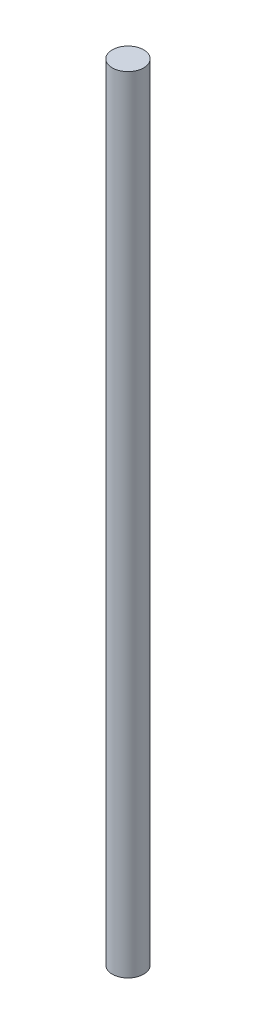
ISO-10303-21;
HEADER;
FILE_DESCRIPTION(('STEP AP214'),'2;1');
FILE_NAME('part.step','',(''),(''),'','','');
FILE_SCHEMA(('AUTOMOTIVE_DESIGN { 1 0 10303 214 1 1 1 1 }'));
ENDSEC;
DATA;
#1=APPLICATION_CONTEXT('core data for automotive mechanical design processes');
#2=APPLICATION_PROTOCOL_DEFINITION('international standard','automotive_design',2000,#1);
#3=PRODUCT_CONTEXT('',#1,'mechanical');
#4=PRODUCT('Part','Part','',(#3));
#5=PRODUCT_RELATED_PRODUCT_CATEGORY('part','',(#4));
#6=PRODUCT_DEFINITION_FORMATION('','',#4);
#7=PRODUCT_DEFINITION_CONTEXT('part definition',#1,'design');
#8=PRODUCT_DEFINITION('design','',#6,#7);
#9=PRODUCT_DEFINITION_SHAPE('','',#8);
#10=(LENGTH_UNIT() NAMED_UNIT(*) SI_UNIT(.MILLI.,.METRE.));
#11=(NAMED_UNIT(*) PLANE_ANGLE_UNIT() SI_UNIT($,.RADIAN.));
#12=(NAMED_UNIT(*) SI_UNIT($,.STERADIAN.) SOLID_ANGLE_UNIT());
#13=UNCERTAINTY_MEASURE_WITH_UNIT(LENGTH_MEASURE(1.E-05),#10,'distance_accuracy_value','');
#14=(GEOMETRIC_REPRESENTATION_CONTEXT(3) GLOBAL_UNCERTAINTY_ASSIGNED_CONTEXT((#13)) GLOBAL_UNIT_ASSIGNED_CONTEXT((#10,
#11,#12)) REPRESENTATION_CONTEXT('',''));
#15=CARTESIAN_POINT('',(0.,0.,0.));
#16=DIRECTION('',(0.,0.,1.));
#17=DIRECTION('',(1.,0.,0.));
#18=AXIS2_PLACEMENT_3D('',#15,#16,#17);
#19=CARTESIAN_POINT('',(0.,100.,0.));
#20=DIRECTION('',(0.,-1.,0.));
#21=DIRECTION('',(0.,0.,-1.));
#22=AXIS2_PLACEMENT_3D('',#19,#20,#21);
#23=CYLINDRICAL_SURFACE('',#22,2.);
#24=CARTESIAN_POINT('',(0.,100.,0.));
#25=DIRECTION('',(0.,1.,0.));
#26=DIRECTION('',(0.,0.,1.));
#27=AXIS2_PLACEMENT_3D('',#24,#25,#26);
#28=CIRCLE('',#27,2.);
#29=CARTESIAN_POINT('',(0.,100.,2.));
#30=VERTEX_POINT('',#29);
#31=EDGE_CURVE('E10',#30,#30,#28,.T.);
#32=ORIENTED_EDGE('',*,*,#31,.F.);
#33=EDGE_LOOP('',(#32));
#34=FACE_BOUND('',#33,.T.);
#35=CARTESIAN_POINT('',(0.,0.,0.));
#36=DIRECTION('',(0.,1.,0.));
#37=DIRECTION('',(0.,0.,1.));
#38=AXIS2_PLACEMENT_3D('',#35,#36,#37);
#39=CIRCLE('',#38,2.);
#40=CARTESIAN_POINT('',(0.,0.,2.));
#41=VERTEX_POINT('',#40);
#42=EDGE_CURVE('E34',#41,#41,#39,.T.);
#43=ORIENTED_EDGE('',*,*,#42,.T.);
#44=EDGE_LOOP('',(#43));
#45=FACE_BOUND('',#44,.T.);
#46=ADVANCED_FACE('F31',(#34,#45),#23,.T.);
#47=CARTESIAN_POINT('',(0.,100.,0.));
#48=DIRECTION('',(0.,1.,0.));
#49=DIRECTION('',(0.,0.,1.));
#50=AXIS2_PLACEMENT_3D('',#47,#48,#49);
#51=PLANE('',#50);
#52=ORIENTED_EDGE('',*,*,#31,.T.);
#53=EDGE_LOOP('',(#52));
#54=FACE_BOUND('',#53,.T.);
#55=ADVANCED_FACE('F46',(#54),#51,.T.);
#56=CARTESIAN_POINT('',(0.,0.,0.));
#57=DIRECTION('',(0.,1.,0.));
#58=DIRECTION('',(0.,0.,1.));
#59=AXIS2_PLACEMENT_3D('',#56,#57,#58);
#60=PLANE('',#59);
#61=ORIENTED_EDGE('',*,*,#42,.F.);
#62=EDGE_LOOP('',(#61));
#63=FACE_BOUND('',#62,.T.);
#64=ADVANCED_FACE('F44',(#63),#60,.F.);
#65=CLOSED_SHELL('',(#46,#55,#64));
#66=MANIFOLD_SOLID_BREP('B2',#65);
#67=ADVANCED_BREP_SHAPE_REPRESENTATION('',(#18,#66),#14);
#68=SHAPE_DEFINITION_REPRESENTATION(#9,#67);
ENDSEC;
END-ISO-10303-21;
